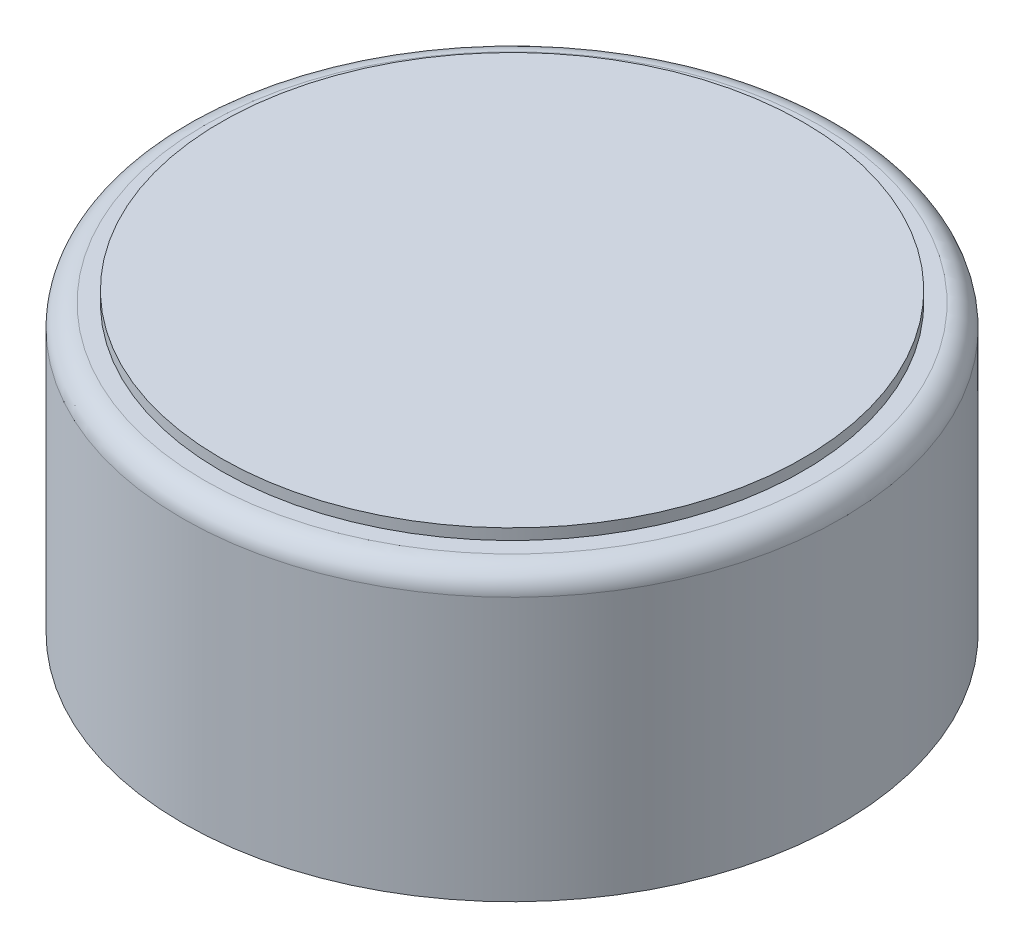
ISO-10303-21;
HEADER;
FILE_DESCRIPTION(('STEP AP214'),'2;1');
FILE_NAME('part.step','',(''),(''),'','','');
FILE_SCHEMA(('AUTOMOTIVE_DESIGN { 1 0 10303 214 1 1 1 1 }'));
ENDSEC;
DATA;
#1=APPLICATION_CONTEXT('core data for automotive mechanical design processes');
#2=APPLICATION_PROTOCOL_DEFINITION('international standard','automotive_design',2000,#1);
#3=PRODUCT_CONTEXT('',#1,'mechanical');
#4=PRODUCT('Part','Part','',(#3));
#5=PRODUCT_RELATED_PRODUCT_CATEGORY('part','',(#4));
#6=PRODUCT_DEFINITION_FORMATION('','',#4);
#7=PRODUCT_DEFINITION_CONTEXT('part definition',#1,'design');
#8=PRODUCT_DEFINITION('design','',#6,#7);
#9=PRODUCT_DEFINITION_SHAPE('','',#8);
#10=(LENGTH_UNIT() NAMED_UNIT(*) SI_UNIT(.MILLI.,.METRE.));
#11=(NAMED_UNIT(*) PLANE_ANGLE_UNIT() SI_UNIT($,.RADIAN.));
#12=(NAMED_UNIT(*) SI_UNIT($,.STERADIAN.) SOLID_ANGLE_UNIT());
#13=UNCERTAINTY_MEASURE_WITH_UNIT(LENGTH_MEASURE(1.E-05),#10,'distance_accuracy_value','');
#14=(GEOMETRIC_REPRESENTATION_CONTEXT(3) GLOBAL_UNCERTAINTY_ASSIGNED_CONTEXT((#13)) GLOBAL_UNIT_ASSIGNED_CONTEXT((#10,
#11,#12)) REPRESENTATION_CONTEXT('',''));
#15=CARTESIAN_POINT('',(0.,0.,0.));
#16=DIRECTION('',(0.,0.,1.));
#17=DIRECTION('',(1.,0.,0.));
#18=AXIS2_PLACEMENT_3D('',#15,#16,#17);
#19=CARTESIAN_POINT('',(0.,0.,0.));
#20=DIRECTION('',(0.,1.,0.));
#21=DIRECTION('',(0.,0.,1.));
#22=AXIS2_PLACEMENT_3D('',#19,#20,#21);
#23=PLANE('',#22);
#24=CARTESIAN_POINT('',(-1.27,0.,1.27));
#25=DIRECTION('',(0.,1.,0.));
#26=DIRECTION('',(0.,0.,1.));
#27=AXIS2_PLACEMENT_3D('',#24,#25,#26);
#28=CIRCLE('',#27,0.2);
#29=CARTESIAN_POINT('',(-1.27,0.,1.47));
#30=VERTEX_POINT('',#29);
#31=EDGE_CURVE('E38',#30,#30,#28,.F.);
#32=ORIENTED_EDGE('',*,*,#31,.F.);
#33=EDGE_LOOP('',(#32));
#34=FACE_BOUND('',#33,.T.);
#35=CARTESIAN_POINT('',(0.,0.,0.));
#36=DIRECTION('',(0.,1.,0.));
#37=DIRECTION('',(0.,0.,1.));
#38=AXIS2_PLACEMENT_3D('',#35,#36,#37);
#39=CIRCLE('',#38,3.);
#40=CARTESIAN_POINT('',(0.,0.,3.));
#41=VERTEX_POINT('',#40);
#42=EDGE_CURVE('E51',#41,#41,#39,.T.);
#43=ORIENTED_EDGE('',*,*,#42,.F.);
#44=EDGE_LOOP('',(#43));
#45=FACE_BOUND('',#44,.T.);
#46=CARTESIAN_POINT('',(-1.27,0.,-1.27));
#47=DIRECTION('',(0.,1.,0.));
#48=DIRECTION('',(0.,0.,1.));
#49=AXIS2_PLACEMENT_3D('',#46,#47,#48);
#50=CIRCLE('',#49,0.25);
#51=CARTESIAN_POINT('',(-1.27,0.,-1.02));
#52=VERTEX_POINT('',#51);
#53=EDGE_CURVE('E10',#52,#52,#50,.F.);
#54=ORIENTED_EDGE('',*,*,#53,.F.);
#55=EDGE_LOOP('',(#54));
#56=FACE_BOUND('',#55,.T.);
#57=ADVANCED_FACE('F31',(#34,#45,#56),#23,.F.);
#58=CARTESIAN_POINT('',(0.,2.6,0.));
#59=DIRECTION('',(0.,1.,0.));
#60=DIRECTION('',(0.,0.,1.));
#61=AXIS2_PLACEMENT_3D('',#58,#59,#60);
#62=PLANE('',#61);
#63=CARTESIAN_POINT('',(0.,2.6,0.));
#64=DIRECTION('',(0.,1.,0.));
#65=DIRECTION('',(0.,0.,1.));
#66=AXIS2_PLACEMENT_3D('',#63,#64,#65);
#67=CIRCLE('',#66,2.8);
#68=CARTESIAN_POINT('',(0.,2.6,2.8));
#69=VERTEX_POINT('',#68);
#70=EDGE_CURVE('E46',#69,#69,#67,.T.);
#71=ORIENTED_EDGE('',*,*,#70,.T.);
#72=EDGE_LOOP('',(#71));
#73=FACE_BOUND('',#72,.T.);
#74=CARTESIAN_POINT('',(0.,2.6,0.));
#75=DIRECTION('',(0.,1.,0.));
#76=DIRECTION('',(0.,0.,1.));
#77=AXIS2_PLACEMENT_3D('',#74,#75,#76);
#78=CIRCLE('',#77,2.65);
#79=CARTESIAN_POINT('',(0.,2.6,2.65));
#80=VERTEX_POINT('',#79);
#81=EDGE_CURVE('E55',#80,#80,#78,.T.);
#82=ORIENTED_EDGE('',*,*,#81,.F.);
#83=EDGE_LOOP('',(#82));
#84=FACE_BOUND('',#83,.T.);
#85=ADVANCED_FACE('F82',(#73,#84),#62,.T.);
#86=CARTESIAN_POINT('',(0.,2.6,0.));
#87=DIRECTION('',(0.,-1.,0.));
#88=DIRECTION('',(0.,0.,-1.));
#89=AXIS2_PLACEMENT_3D('',#86,#87,#88);
#90=CYLINDRICAL_SURFACE('',#89,3.);
#91=CARTESIAN_POINT('',(0.,2.4,0.));
#92=DIRECTION('',(0.,1.,0.));
#93=DIRECTION('',(0.,0.,1.));
#94=AXIS2_PLACEMENT_3D('',#91,#92,#93);
#95=CIRCLE('',#94,3.);
#96=CARTESIAN_POINT('',(0.,2.4,3.));
#97=VERTEX_POINT('',#96);
#98=EDGE_CURVE('E42',#97,#97,#95,.F.);
#99=ORIENTED_EDGE('',*,*,#98,.T.);
#100=EDGE_LOOP('',(#99));
#101=FACE_BOUND('',#100,.T.);
#102=ORIENTED_EDGE('',*,*,#42,.T.);
#103=EDGE_LOOP('',(#102));
#104=FACE_BOUND('',#103,.T.);
#105=ADVANCED_FACE('F88',(#101,#104),#90,.T.);
#106=CARTESIAN_POINT('',(0.,2.4,0.));
#107=DIRECTION('',(0.,1.,0.));
#108=DIRECTION('',(0.,0.,1.));
#109=AXIS2_PLACEMENT_3D('',#106,#107,#108);
#110=TOROIDAL_SURFACE('',#109,2.8,0.2);
#111=ORIENTED_EDGE('',*,*,#98,.F.);
#112=EDGE_LOOP('',(#111));
#113=FACE_BOUND('',#112,.T.);
#114=ORIENTED_EDGE('',*,*,#70,.F.);
#115=EDGE_LOOP('',(#114));
#116=FACE_BOUND('',#115,.T.);
#117=ADVANCED_FACE('F33',(#113,#116),#110,.T.);
#118=CARTESIAN_POINT('',(0.,2.7,0.));
#119=DIRECTION('',(0.,-1.,0.));
#120=DIRECTION('',(0.,0.,-1.));
#121=AXIS2_PLACEMENT_3D('',#118,#119,#120);
#122=CYLINDRICAL_SURFACE('',#121,2.65);
#123=CARTESIAN_POINT('',(0.,2.7,0.));
#124=DIRECTION('',(0.,1.,0.));
#125=DIRECTION('',(0.,0.,1.));
#126=AXIS2_PLACEMENT_3D('',#123,#124,#125);
#127=CIRCLE('',#126,2.65);
#128=CARTESIAN_POINT('',(0.,2.7,2.65));
#129=VERTEX_POINT('',#128);
#130=EDGE_CURVE('E54',#129,#129,#127,.T.);
#131=ORIENTED_EDGE('',*,*,#130,.F.);
#132=EDGE_LOOP('',(#131));
#133=FACE_BOUND('',#132,.T.);
#134=ORIENTED_EDGE('',*,*,#81,.T.);
#135=EDGE_LOOP('',(#134));
#136=FACE_BOUND('',#135,.T.);
#137=ADVANCED_FACE('F98',(#133,#136),#122,.T.);
#138=CARTESIAN_POINT('',(0.,2.7,0.));
#139=DIRECTION('',(0.,1.,0.));
#140=DIRECTION('',(0.,0.,1.));
#141=AXIS2_PLACEMENT_3D('',#138,#139,#140);
#142=PLANE('',#141);
#143=ORIENTED_EDGE('',*,*,#130,.T.);
#144=EDGE_LOOP('',(#143));
#145=FACE_BOUND('',#144,.T.);
#146=ADVANCED_FACE('F110',(#145),#142,.T.);
#147=CARTESIAN_POINT('',(-1.27,-1.,1.27));
#148=DIRECTION('',(0.,1.,0.));
#149=DIRECTION('',(0.,0.,1.));
#150=AXIS2_PLACEMENT_3D('',#147,#148,#149);
#151=CYLINDRICAL_SURFACE('',#150,0.2);
#152=CARTESIAN_POINT('',(-1.27,-1.,1.27));
#153=DIRECTION('',(0.,-1.,0.));
#154=DIRECTION('',(0.,0.,-1.));
#155=AXIS2_PLACEMENT_3D('',#152,#153,#154);
#156=CIRCLE('',#155,0.2);
#157=CARTESIAN_POINT('',(-1.27,-1.,1.07));
#158=VERTEX_POINT('',#157);
#159=EDGE_CURVE('E58',#158,#158,#156,.T.);
#160=ORIENTED_EDGE('',*,*,#159,.F.);
#161=EDGE_LOOP('',(#160));
#162=FACE_BOUND('',#161,.T.);
#163=ORIENTED_EDGE('',*,*,#31,.T.);
#164=EDGE_LOOP('',(#163));
#165=FACE_BOUND('',#164,.T.);
#166=ADVANCED_FACE('F78',(#162,#165),#151,.T.);
#167=CARTESIAN_POINT('',(-1.27,-1.,1.27));
#168=DIRECTION('',(0.,-1.,0.));
#169=DIRECTION('',(0.,0.,-1.));
#170=AXIS2_PLACEMENT_3D('',#167,#168,#169);
#171=PLANE('',#170);
#172=ORIENTED_EDGE('',*,*,#159,.T.);
#173=EDGE_LOOP('',(#172));
#174=FACE_BOUND('',#173,.T.);
#175=ADVANCED_FACE('F71',(#174),#171,.T.);
#176=CARTESIAN_POINT('',(-1.27,-1.,-1.27));
#177=DIRECTION('',(0.,1.,0.));
#178=DIRECTION('',(0.,0.,1.));
#179=AXIS2_PLACEMENT_3D('',#176,#177,#178);
#180=CYLINDRICAL_SURFACE('',#179,0.25);
#181=CARTESIAN_POINT('',(-1.27,-1.,-1.27));
#182=DIRECTION('',(0.,-1.,0.));
#183=DIRECTION('',(0.,0.,-1.));
#184=AXIS2_PLACEMENT_3D('',#181,#182,#183);
#185=CIRCLE('',#184,0.25);
#186=CARTESIAN_POINT('',(-1.27,-1.,-1.52));
#187=VERTEX_POINT('',#186);
#188=EDGE_CURVE('E63',#187,#187,#185,.T.);
#189=ORIENTED_EDGE('',*,*,#188,.F.);
#190=EDGE_LOOP('',(#189));
#191=FACE_BOUND('',#190,.T.);
#192=ORIENTED_EDGE('',*,*,#53,.T.);
#193=EDGE_LOOP('',(#192));
#194=FACE_BOUND('',#193,.T.);
#195=ADVANCED_FACE('F69',(#191,#194),#180,.T.);
#196=CARTESIAN_POINT('',(-1.27,-1.,-1.27));
#197=DIRECTION('',(0.,-1.,0.));
#198=DIRECTION('',(0.,0.,-1.));
#199=AXIS2_PLACEMENT_3D('',#196,#197,#198);
#200=PLANE('',#199);
#201=ORIENTED_EDGE('',*,*,#188,.T.);
#202=EDGE_LOOP('',(#201));
#203=FACE_BOUND('',#202,.T.);
#204=ADVANCED_FACE('F67',(#203),#200,.T.);
#205=CLOSED_SHELL('',(#57,#85,#105,#117,#137,#146,#166,#175,#195,#204));
#206=MANIFOLD_SOLID_BREP('B2',#205);
#207=ADVANCED_BREP_SHAPE_REPRESENTATION('',(#18,#206),#14);
#208=SHAPE_DEFINITION_REPRESENTATION(#9,#207);
ENDSEC;
END-ISO-10303-21;
